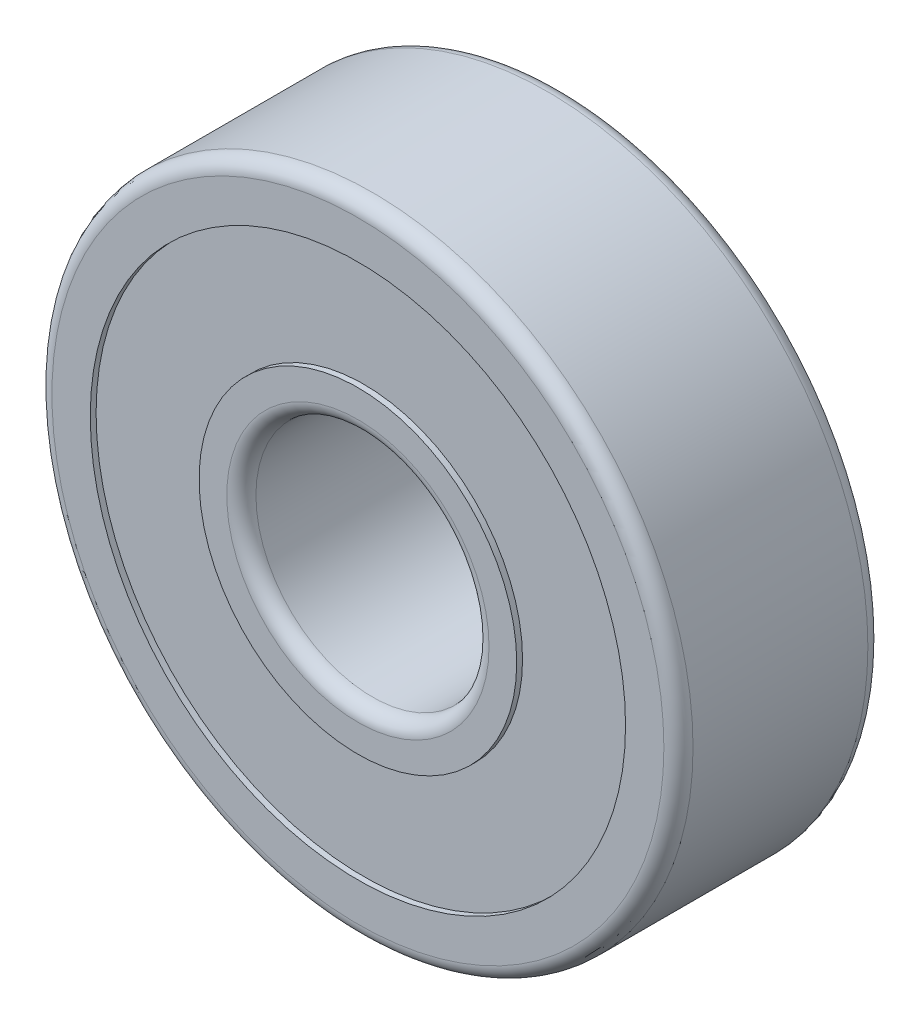
ISO-10303-21;
HEADER;
FILE_DESCRIPTION(('STEP AP214'),'2;1');
FILE_NAME('part.step','',(''),(''),'','','');
FILE_SCHEMA(('AUTOMOTIVE_DESIGN { 1 0 10303 214 1 1 1 1 }'));
ENDSEC;
DATA;
#1=APPLICATION_CONTEXT('core data for automotive mechanical design processes');
#2=APPLICATION_PROTOCOL_DEFINITION('international standard','automotive_design',2000,#1);
#3=PRODUCT_CONTEXT('',#1,'mechanical');
#4=PRODUCT('Part','Part','',(#3));
#5=PRODUCT_RELATED_PRODUCT_CATEGORY('part','',(#4));
#6=PRODUCT_DEFINITION_FORMATION('','',#4);
#7=PRODUCT_DEFINITION_CONTEXT('part definition',#1,'design');
#8=PRODUCT_DEFINITION('design','',#6,#7);
#9=PRODUCT_DEFINITION_SHAPE('','',#8);
#10=(LENGTH_UNIT() NAMED_UNIT(*) SI_UNIT(.MILLI.,.METRE.));
#11=(NAMED_UNIT(*) PLANE_ANGLE_UNIT() SI_UNIT($,.RADIAN.));
#12=(NAMED_UNIT(*) SI_UNIT($,.STERADIAN.) SOLID_ANGLE_UNIT());
#13=UNCERTAINTY_MEASURE_WITH_UNIT(LENGTH_MEASURE(1.E-05),#10,'distance_accuracy_value','');
#14=(GEOMETRIC_REPRESENTATION_CONTEXT(3) GLOBAL_UNCERTAINTY_ASSIGNED_CONTEXT((#13)) GLOBAL_UNIT_ASSIGNED_CONTEXT((#10,
#11,#12)) REPRESENTATION_CONTEXT('',''));
#15=CARTESIAN_POINT('',(0.,0.,0.));
#16=DIRECTION('',(0.,0.,1.));
#17=DIRECTION('',(1.,0.,0.));
#18=AXIS2_PLACEMENT_3D('',#15,#16,#17);
#19=CARTESIAN_POINT('',(0.,0.,-3.5));
#20=DIRECTION('',(0.,0.,1.));
#21=DIRECTION('',(1.,0.,0.));
#22=AXIS2_PLACEMENT_3D('',#19,#20,#21);
#23=PLANE('',#22);
#24=CARTESIAN_POINT('',(0.,0.,-3.5));
#25=DIRECTION('',(0.,0.,1.));
#26=DIRECTION('',(1.,0.,0.));
#27=AXIS2_PLACEMENT_3D('',#24,#25,#26);
#28=CIRCLE('',#27,10.5);
#29=CARTESIAN_POINT('',(10.5,0.,-3.5));
#30=VERTEX_POINT('',#29);
#31=EDGE_CURVE('E40',#30,#30,#28,.F.);
#32=ORIENTED_EDGE('',*,*,#31,.T.);
#33=EDGE_LOOP('',(#32));
#34=FACE_BOUND('',#33,.T.);
#35=CARTESIAN_POINT('',(0.,0.,-3.5));
#36=DIRECTION('',(0.,0.,1.));
#37=DIRECTION('',(1.,0.,0.));
#38=AXIS2_PLACEMENT_3D('',#35,#36,#37);
#39=CIRCLE('',#38,9.18472454375041);
#40=CARTESIAN_POINT('',(9.18472454375041,0.,-3.5));
#41=VERTEX_POINT('',#40);
#42=EDGE_CURVE('E78',#41,#41,#39,.T.);
#43=ORIENTED_EDGE('',*,*,#42,.T.);
#44=EDGE_LOOP('',(#43));
#45=FACE_BOUND('',#44,.T.);
#46=ADVANCED_FACE('F33',(#34,#45),#23,.F.);
#47=CARTESIAN_POINT('',(0.,0.,3.5));
#48=DIRECTION('',(0.,0.,1.));
#49=DIRECTION('',(1.,0.,0.));
#50=AXIS2_PLACEMENT_3D('',#47,#48,#49);
#51=PLANE('',#50);
#52=CARTESIAN_POINT('',(0.,0.,3.5));
#53=DIRECTION('',(0.,0.,1.));
#54=DIRECTION('',(1.,0.,0.));
#55=AXIS2_PLACEMENT_3D('',#52,#53,#54);
#56=CIRCLE('',#55,4.5);
#57=CARTESIAN_POINT('',(4.5,0.,3.5));
#58=VERTEX_POINT('',#57);
#59=EDGE_CURVE('E56',#58,#58,#56,.F.);
#60=ORIENTED_EDGE('',*,*,#59,.T.);
#61=EDGE_LOOP('',(#60));
#62=FACE_BOUND('',#61,.T.);
#63=CARTESIAN_POINT('',(0.,0.,3.5));
#64=DIRECTION('',(0.,0.,1.));
#65=DIRECTION('',(1.,0.,0.));
#66=AXIS2_PLACEMENT_3D('',#63,#64,#65);
#67=CIRCLE('',#66,5.45025485148313);
#68=CARTESIAN_POINT('',(5.45025485148313,0.,3.5));
#69=VERTEX_POINT('',#68);
#70=EDGE_CURVE('E72',#69,#69,#67,.T.);
#71=ORIENTED_EDGE('',*,*,#70,.T.);
#72=EDGE_LOOP('',(#71));
#73=FACE_BOUND('',#72,.T.);
#74=ADVANCED_FACE('F112',(#62,#73),#51,.T.);
#75=CARTESIAN_POINT('',(0.,0.,3.5));
#76=DIRECTION('',(0.,0.,1.));
#77=DIRECTION('',(1.,0.,0.));
#78=AXIS2_PLACEMENT_3D('',#75,#76,#77);
#79=CIRCLE('',#78,10.5);
#80=CARTESIAN_POINT('',(10.5,0.,3.5));
#81=VERTEX_POINT('',#80);
#82=EDGE_CURVE('E53',#81,#81,#79,.T.);
#83=ORIENTED_EDGE('',*,*,#82,.T.);
#84=EDGE_LOOP('',(#83));
#85=FACE_BOUND('',#84,.T.);
#86=CARTESIAN_POINT('',(0.,0.,3.5));
#87=DIRECTION('',(0.,0.,1.));
#88=DIRECTION('',(1.,0.,0.));
#89=AXIS2_PLACEMENT_3D('',#86,#87,#88);
#90=CIRCLE('',#89,9.18472454375041);
#91=CARTESIAN_POINT('',(9.18472454375041,0.,3.5));
#92=VERTEX_POINT('',#91);
#93=EDGE_CURVE('E66',#92,#92,#90,.T.);
#94=ORIENTED_EDGE('',*,*,#93,.F.);
#95=EDGE_LOOP('',(#94));
#96=FACE_BOUND('',#95,.T.);
#97=ADVANCED_FACE('F103',(#85,#96),#51,.T.);
#98=CARTESIAN_POINT('',(0.,0.,-3.5));
#99=DIRECTION('',(0.,0.,1.));
#100=DIRECTION('',(1.,0.,0.));
#101=AXIS2_PLACEMENT_3D('',#98,#99,#100);
#102=CIRCLE('',#101,4.5);
#103=CARTESIAN_POINT('',(4.5,0.,-3.5));
#104=VERTEX_POINT('',#103);
#105=EDGE_CURVE('E10',#104,#104,#102,.T.);
#106=ORIENTED_EDGE('',*,*,#105,.T.);
#107=EDGE_LOOP('',(#106));
#108=FACE_BOUND('',#107,.T.);
#109=CARTESIAN_POINT('',(0.,0.,-3.5));
#110=DIRECTION('',(0.,0.,1.));
#111=DIRECTION('',(1.,0.,0.));
#112=AXIS2_PLACEMENT_3D('',#109,#110,#111);
#113=CIRCLE('',#112,5.45025485148313);
#114=CARTESIAN_POINT('',(5.45025485148313,0.,-3.5));
#115=VERTEX_POINT('',#114);
#116=EDGE_CURVE('E84',#115,#115,#113,.T.);
#117=ORIENTED_EDGE('',*,*,#116,.F.);
#118=EDGE_LOOP('',(#117));
#119=FACE_BOUND('',#118,.T.);
#120=ADVANCED_FACE('F100',(#108,#119),#23,.F.);
#121=CARTESIAN_POINT('',(0.,0.,3.5));
#122=DIRECTION('',(0.,0.,-1.));
#123=DIRECTION('',(-1.,0.,0.));
#124=AXIS2_PLACEMENT_3D('',#121,#122,#123);
#125=CYLINDRICAL_SURFACE('',#124,11.);
#126=CARTESIAN_POINT('',(0.,0.,3.));
#127=DIRECTION('',(0.,0.,1.));
#128=DIRECTION('',(1.,0.,0.));
#129=AXIS2_PLACEMENT_3D('',#126,#127,#128);
#130=CIRCLE('',#129,11.);
#131=CARTESIAN_POINT('',(11.,0.,3.));
#132=VERTEX_POINT('',#131);
#133=EDGE_CURVE('E44',#132,#132,#130,.F.);
#134=ORIENTED_EDGE('',*,*,#133,.T.);
#135=EDGE_LOOP('',(#134));
#136=FACE_BOUND('',#135,.T.);
#137=CARTESIAN_POINT('',(0.,0.,-3.));
#138=DIRECTION('',(0.,0.,1.));
#139=DIRECTION('',(1.,0.,0.));
#140=AXIS2_PLACEMENT_3D('',#137,#138,#139);
#141=CIRCLE('',#140,11.);
#142=CARTESIAN_POINT('',(11.,0.,-3.));
#143=VERTEX_POINT('',#142);
#144=EDGE_CURVE('E48',#143,#143,#141,.T.);
#145=ORIENTED_EDGE('',*,*,#144,.T.);
#146=EDGE_LOOP('',(#145));
#147=FACE_BOUND('',#146,.T.);
#148=ADVANCED_FACE('F102',(#136,#147),#125,.T.);
#149=CARTESIAN_POINT('',(0.,0.,3.5));
#150=DIRECTION('',(0.,0.,-1.));
#151=DIRECTION('',(-1.,0.,0.));
#152=AXIS2_PLACEMENT_3D('',#149,#150,#151);
#153=CYLINDRICAL_SURFACE('',#152,4.);
#154=CARTESIAN_POINT('',(0.,0.,3.));
#155=DIRECTION('',(0.,0.,1.));
#156=DIRECTION('',(1.,0.,0.));
#157=AXIS2_PLACEMENT_3D('',#154,#155,#156);
#158=CIRCLE('',#157,4.);
#159=CARTESIAN_POINT('',(4.,0.,3.));
#160=VERTEX_POINT('',#159);
#161=EDGE_CURVE('E59',#160,#160,#158,.T.);
#162=ORIENTED_EDGE('',*,*,#161,.T.);
#163=EDGE_LOOP('',(#162));
#164=FACE_BOUND('',#163,.T.);
#165=CARTESIAN_POINT('',(0.,0.,-3.));
#166=DIRECTION('',(0.,0.,1.));
#167=DIRECTION('',(1.,0.,0.));
#168=AXIS2_PLACEMENT_3D('',#165,#166,#167);
#169=CIRCLE('',#168,4.);
#170=CARTESIAN_POINT('',(4.,0.,-3.));
#171=VERTEX_POINT('',#170);
#172=EDGE_CURVE('E62',#171,#171,#169,.F.);
#173=ORIENTED_EDGE('',*,*,#172,.T.);
#174=EDGE_LOOP('',(#173));
#175=FACE_BOUND('',#174,.T.);
#176=ADVANCED_FACE('F109',(#164,#175),#153,.F.);
#177=CARTESIAN_POINT('',(0.,0.,3.3));
#178=DIRECTION('',(0.,0.,1.));
#179=DIRECTION('',(1.,0.,0.));
#180=AXIS2_PLACEMENT_3D('',#177,#178,#179);
#181=CYLINDRICAL_SURFACE('',#180,9.18472454375041);
#182=CARTESIAN_POINT('',(0.,0.,3.3));
#183=DIRECTION('',(0.,0.,1.));
#184=DIRECTION('',(1.,0.,0.));
#185=AXIS2_PLACEMENT_3D('',#182,#183,#184);
#186=CIRCLE('',#185,9.18472454375041);
#187=CARTESIAN_POINT('',(9.18472454375041,0.,3.3));
#188=VERTEX_POINT('',#187);
#189=EDGE_CURVE('E65',#188,#188,#186,.T.);
#190=ORIENTED_EDGE('',*,*,#189,.F.);
#191=EDGE_LOOP('',(#190));
#192=FACE_BOUND('',#191,.T.);
#193=ORIENTED_EDGE('',*,*,#93,.T.);
#194=EDGE_LOOP('',(#193));
#195=FACE_BOUND('',#194,.T.);
#196=ADVANCED_FACE('F139',(#192,#195),#181,.F.);
#197=CARTESIAN_POINT('',(0.,0.,3.3));
#198=DIRECTION('',(0.,0.,1.));
#199=DIRECTION('',(1.,0.,0.));
#200=AXIS2_PLACEMENT_3D('',#197,#198,#199);
#201=PLANE('',#200);
#202=CARTESIAN_POINT('',(0.,0.,3.3));
#203=DIRECTION('',(0.,0.,1.));
#204=DIRECTION('',(1.,0.,0.));
#205=AXIS2_PLACEMENT_3D('',#202,#203,#204);
#206=CIRCLE('',#205,5.45025485148313);
#207=CARTESIAN_POINT('',(5.45025485148313,0.,3.3));
#208=VERTEX_POINT('',#207);
#209=EDGE_CURVE('E69',#208,#208,#206,.T.);
#210=ORIENTED_EDGE('',*,*,#209,.F.);
#211=EDGE_LOOP('',(#210));
#212=FACE_BOUND('',#211,.T.);
#213=ORIENTED_EDGE('',*,*,#189,.T.);
#214=EDGE_LOOP('',(#213));
#215=FACE_BOUND('',#214,.T.);
#216=ADVANCED_FACE('F135',(#212,#215),#201,.T.);
#217=CARTESIAN_POINT('',(0.,0.,3.3));
#218=DIRECTION('',(0.,0.,1.));
#219=DIRECTION('',(1.,0.,0.));
#220=AXIS2_PLACEMENT_3D('',#217,#218,#219);
#221=CYLINDRICAL_SURFACE('',#220,5.45025485148313);
#222=ORIENTED_EDGE('',*,*,#209,.T.);
#223=EDGE_LOOP('',(#222));
#224=FACE_BOUND('',#223,.T.);
#225=ORIENTED_EDGE('',*,*,#70,.F.);
#226=EDGE_LOOP('',(#225));
#227=FACE_BOUND('',#226,.T.);
#228=ADVANCED_FACE('F129',(#224,#227),#221,.T.);
#229=CARTESIAN_POINT('',(0.,0.,-3.3));
#230=DIRECTION('',(0.,0.,-1.));
#231=DIRECTION('',(1.,0.,0.));
#232=AXIS2_PLACEMENT_3D('',#229,#230,#231);
#233=PLANE('',#232);
#234=CARTESIAN_POINT('',(0.,0.,-3.3));
#235=DIRECTION('',(0.,0.,1.));
#236=DIRECTION('',(1.,0.,0.));
#237=AXIS2_PLACEMENT_3D('',#234,#235,#236);
#238=CIRCLE('',#237,9.18472454375041);
#239=CARTESIAN_POINT('',(9.18472454375041,0.,-3.3));
#240=VERTEX_POINT('',#239);
#241=EDGE_CURVE('E75',#240,#240,#238,.T.);
#242=ORIENTED_EDGE('',*,*,#241,.F.);
#243=EDGE_LOOP('',(#242));
#244=FACE_BOUND('',#243,.T.);
#245=CARTESIAN_POINT('',(0.,0.,-3.3));
#246=DIRECTION('',(0.,0.,1.));
#247=DIRECTION('',(1.,0.,0.));
#248=AXIS2_PLACEMENT_3D('',#245,#246,#247);
#249=CIRCLE('',#248,5.45025485148313);
#250=CARTESIAN_POINT('',(5.45025485148313,0.,-3.3));
#251=VERTEX_POINT('',#250);
#252=EDGE_CURVE('E81',#251,#251,#249,.T.);
#253=ORIENTED_EDGE('',*,*,#252,.T.);
#254=EDGE_LOOP('',(#253));
#255=FACE_BOUND('',#254,.T.);
#256=ADVANCED_FACE('F90',(#244,#255),#233,.T.);
#257=CARTESIAN_POINT('',(0.,0.,-3.3));
#258=DIRECTION('',(0.,0.,-1.));
#259=DIRECTION('',(-1.,0.,0.));
#260=AXIS2_PLACEMENT_3D('',#257,#258,#259);
#261=CYLINDRICAL_SURFACE('',#260,9.18472454375041);
#262=ORIENTED_EDGE('',*,*,#241,.T.);
#263=EDGE_LOOP('',(#262));
#264=FACE_BOUND('',#263,.T.);
#265=ORIENTED_EDGE('',*,*,#42,.F.);
#266=EDGE_LOOP('',(#265));
#267=FACE_BOUND('',#266,.T.);
#268=ADVANCED_FACE('F96',(#264,#267),#261,.F.);
#269=CARTESIAN_POINT('',(0.,0.,-3.3));
#270=DIRECTION('',(0.,0.,-1.));
#271=DIRECTION('',(-1.,0.,0.));
#272=AXIS2_PLACEMENT_3D('',#269,#270,#271);
#273=CYLINDRICAL_SURFACE('',#272,5.45025485148313);
#274=ORIENTED_EDGE('',*,*,#252,.F.);
#275=EDGE_LOOP('',(#274));
#276=FACE_BOUND('',#275,.T.);
#277=ORIENTED_EDGE('',*,*,#116,.T.);
#278=EDGE_LOOP('',(#277));
#279=FACE_BOUND('',#278,.T.);
#280=ADVANCED_FACE('F92',(#276,#279),#273,.T.);
#281=CARTESIAN_POINT('',(0.,0.,3.));
#282=DIRECTION('',(0.,0.,1.));
#283=DIRECTION('',(1.,0.,0.));
#284=AXIS2_PLACEMENT_3D('',#281,#282,#283);
#285=TOROIDAL_SURFACE('',#284,4.5,0.5);
#286=ORIENTED_EDGE('',*,*,#59,.F.);
#287=EDGE_LOOP('',(#286));
#288=FACE_BOUND('',#287,.T.);
#289=ORIENTED_EDGE('',*,*,#161,.F.);
#290=EDGE_LOOP('',(#289));
#291=FACE_BOUND('',#290,.T.);
#292=ADVANCED_FACE('F95',(#288,#291),#285,.T.);
#293=CARTESIAN_POINT('',(0.,0.,3.));
#294=DIRECTION('',(0.,0.,1.));
#295=DIRECTION('',(1.,0.,0.));
#296=AXIS2_PLACEMENT_3D('',#293,#294,#295);
#297=TOROIDAL_SURFACE('',#296,10.5,0.5);
#298=ORIENTED_EDGE('',*,*,#133,.F.);
#299=EDGE_LOOP('',(#298));
#300=FACE_BOUND('',#299,.T.);
#301=ORIENTED_EDGE('',*,*,#82,.F.);
#302=EDGE_LOOP('',(#301));
#303=FACE_BOUND('',#302,.T.);
#304=ADVANCED_FACE('F158',(#300,#303),#297,.T.);
#305=CARTESIAN_POINT('',(0.,0.,-3.));
#306=DIRECTION('',(0.,0.,1.));
#307=DIRECTION('',(1.,0.,0.));
#308=AXIS2_PLACEMENT_3D('',#305,#306,#307);
#309=TOROIDAL_SURFACE('',#308,10.5,0.5);
#310=ORIENTED_EDGE('',*,*,#31,.F.);
#311=EDGE_LOOP('',(#310));
#312=FACE_BOUND('',#311,.T.);
#313=ORIENTED_EDGE('',*,*,#144,.F.);
#314=EDGE_LOOP('',(#313));
#315=FACE_BOUND('',#314,.T.);
#316=ADVANCED_FACE('F154',(#312,#315),#309,.T.);
#317=CARTESIAN_POINT('',(0.,0.,-3.));
#318=DIRECTION('',(0.,0.,1.));
#319=DIRECTION('',(1.,0.,0.));
#320=AXIS2_PLACEMENT_3D('',#317,#318,#319);
#321=TOROIDAL_SURFACE('',#320,4.5,0.5);
#322=ORIENTED_EDGE('',*,*,#172,.F.);
#323=EDGE_LOOP('',(#322));
#324=FACE_BOUND('',#323,.T.);
#325=ORIENTED_EDGE('',*,*,#105,.F.);
#326=EDGE_LOOP('',(#325));
#327=FACE_BOUND('',#326,.T.);
#328=ADVANCED_FACE('F35',(#324,#327),#321,.T.);
#329=CLOSED_SHELL('',(#46,#74,#97,#120,#148,#176,#196,#216,#228,#256,#268,#280,#292,#304,#316,#328));
#330=MANIFOLD_SOLID_BREP('B2',#329);
#331=ADVANCED_BREP_SHAPE_REPRESENTATION('',(#18,#330),#14);
#332=SHAPE_DEFINITION_REPRESENTATION(#9,#331);
ENDSEC;
END-ISO-10303-21;
